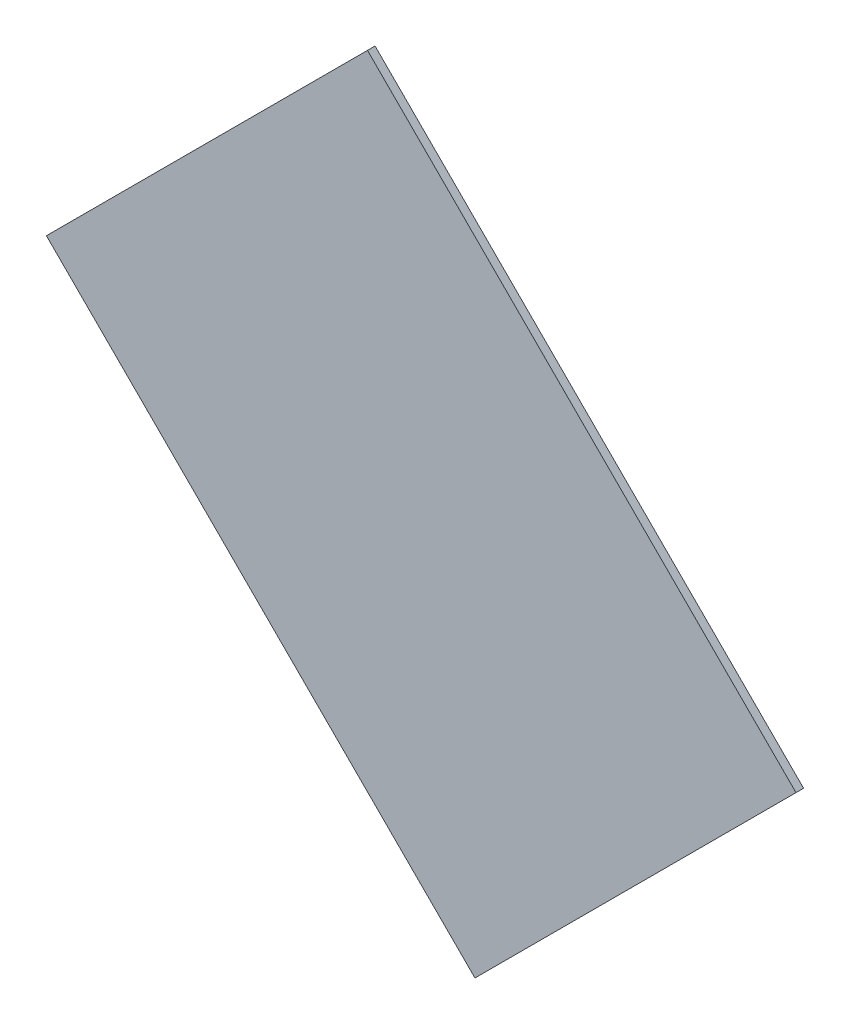
ISO-10303-21;
HEADER;
FILE_DESCRIPTION(('STEP AP214'),'2;1');
FILE_NAME('part.step','',(''),(''),'','','');
FILE_SCHEMA(('AUTOMOTIVE_DESIGN { 1 0 10303 214 1 1 1 1 }'));
ENDSEC;
DATA;
#1=APPLICATION_CONTEXT('core data for automotive mechanical design processes');
#2=APPLICATION_PROTOCOL_DEFINITION('international standard','automotive_design',2000,#1);
#3=PRODUCT_CONTEXT('',#1,'mechanical');
#4=PRODUCT('Part','Part','',(#3));
#5=PRODUCT_RELATED_PRODUCT_CATEGORY('part','',(#4));
#6=PRODUCT_DEFINITION_FORMATION('','',#4);
#7=PRODUCT_DEFINITION_CONTEXT('part definition',#1,'design');
#8=PRODUCT_DEFINITION('design','',#6,#7);
#9=PRODUCT_DEFINITION_SHAPE('','',#8);
#10=(LENGTH_UNIT() NAMED_UNIT(*) SI_UNIT(.MILLI.,.METRE.));
#11=(NAMED_UNIT(*) PLANE_ANGLE_UNIT() SI_UNIT($,.RADIAN.));
#12=(NAMED_UNIT(*) SI_UNIT($,.STERADIAN.) SOLID_ANGLE_UNIT());
#13=UNCERTAINTY_MEASURE_WITH_UNIT(LENGTH_MEASURE(1.E-05),#10,'distance_accuracy_value','');
#14=(GEOMETRIC_REPRESENTATION_CONTEXT(3) GLOBAL_UNCERTAINTY_ASSIGNED_CONTEXT((#13)) GLOBAL_UNIT_ASSIGNED_CONTEXT((#10,
#11,#12)) REPRESENTATION_CONTEXT('',''));
#15=CARTESIAN_POINT('',(0.,0.,0.));
#16=DIRECTION('',(0.,0.,1.));
#17=DIRECTION('',(1.,0.,0.));
#18=AXIS2_PLACEMENT_3D('',#15,#16,#17);
#19=CARTESIAN_POINT('',(-0.07094474000002,0.49480978,0.));
#20=DIRECTION('',(0.707106781186548,-0.707106781186548,0.));
#21=DIRECTION('',(-0.707106781186548,-0.707106781186548,0.));
#22=AXIS2_PLACEMENT_3D('',#19,#20,#21);
#23=PLANE('',#22);
#24=DIRECTION('',(-0.707106781186548,-0.707106781186548,0.));
#25=VECTOR('',#24,1.);
#26=CARTESIAN_POINT('',(-0.07094474000002,0.49480978,0.));
#27=LINE('',#26,#25);
#28=CARTESIAN_POINT('',(-0.07094474000002,0.49480978,0.));
#29=VERTEX_POINT('',#28);
#30=CARTESIAN_POINT('',(-0.49480724,0.07094728000001,0.));
#31=VERTEX_POINT('',#30);
#32=EDGE_CURVE('E11',#29,#31,#27,.T.);
#33=ORIENTED_EDGE('',*,*,#32,.T.);
#34=DIRECTION('',(0.,0.,1.));
#35=VECTOR('',#34,1.);
#36=CARTESIAN_POINT('',(-0.49480724,0.07094728000001,0.));
#37=LINE('',#36,#35);
#38=CARTESIAN_POINT('',(-0.49480724,0.07094728000001,0.00999998));
#39=VERTEX_POINT('',#38);
#40=EDGE_CURVE('E25',#31,#39,#37,.T.);
#41=ORIENTED_EDGE('',*,*,#40,.T.);
#42=DIRECTION('',(-0.707106781186548,-0.707106781186548,0.));
#43=VECTOR('',#42,1.);
#44=CARTESIAN_POINT('',(-0.07094474000002,0.49480978,0.00999998));
#45=LINE('',#44,#43);
#46=CARTESIAN_POINT('',(-0.07094474000002,0.49480978,0.00999998));
#47=VERTEX_POINT('',#46);
#48=EDGE_CURVE('E96',#47,#39,#45,.T.);
#49=ORIENTED_EDGE('',*,*,#48,.F.);
#50=DIRECTION('',(0.,0.,1.));
#51=VECTOR('',#50,1.);
#52=CARTESIAN_POINT('',(-0.07094474000002,0.49480978,0.));
#53=LINE('',#52,#51);
#54=EDGE_CURVE('E91',#29,#47,#53,.T.);
#55=ORIENTED_EDGE('',*,*,#54,.F.);
#56=EDGE_LOOP('',(#33,#41,#49,#55));
#57=FACE_BOUND('',#56,.T.);
#58=ADVANCED_FACE('F17',(#57),#23,.F.);
#59=CARTESIAN_POINT('',(0.49480978,-0.07094727999996,0.));
#60=DIRECTION('',(-0.707108368487266,-0.707105193882266,0.));
#61=DIRECTION('',(-0.707105193882266,0.707108368487266,0.));
#62=AXIS2_PLACEMENT_3D('',#59,#60,#61);
#63=PLANE('',#62);
#64=DIRECTION('',(-0.707105193882266,0.707108368487266,0.));
#65=VECTOR('',#64,1.);
#66=CARTESIAN_POINT('',(0.49480978,-0.07094727999996,0.));
#67=LINE('',#66,#65);
#68=CARTESIAN_POINT('',(0.49480978,-0.07094727999996,0.));
#69=VERTEX_POINT('',#68);
#70=EDGE_CURVE('E73',#69,#29,#67,.T.);
#71=ORIENTED_EDGE('',*,*,#70,.T.);
#72=ORIENTED_EDGE('',*,*,#54,.T.);
#73=DIRECTION('',(-0.707105193882266,0.707108368487266,0.));
#74=VECTOR('',#73,1.);
#75=CARTESIAN_POINT('',(0.49480978,-0.07094727999996,0.00999998));
#76=LINE('',#75,#74);
#77=CARTESIAN_POINT('',(0.49480978,-0.07094727999996,0.00999998));
#78=VERTEX_POINT('',#77);
#79=EDGE_CURVE('E76',#78,#47,#76,.T.);
#80=ORIENTED_EDGE('',*,*,#79,.F.);
#81=DIRECTION('',(0.,0.,1.));
#82=VECTOR('',#81,1.);
#83=CARTESIAN_POINT('',(0.49480978,-0.07094727999996,0.));
#84=LINE('',#83,#82);
#85=EDGE_CURVE('E74',#69,#78,#84,.T.);
#86=ORIENTED_EDGE('',*,*,#85,.F.);
#87=EDGE_LOOP('',(#71,#72,#80,#86));
#88=FACE_BOUND('',#87,.T.);
#89=ADVANCED_FACE('F108',(#88),#63,.F.);
#90=CARTESIAN_POINT('',(0.07094727999998,-0.49480978,0.));
#91=DIRECTION('',(-0.707106781186548,0.707106781186548,0.));
#92=DIRECTION('',(0.707106781186548,0.707106781186548,0.));
#93=AXIS2_PLACEMENT_3D('',#90,#91,#92);
#94=PLANE('',#93);
#95=DIRECTION('',(0.707106781186548,0.707106781186548,0.));
#96=VECTOR('',#95,1.);
#97=CARTESIAN_POINT('',(0.07094727999998,-0.49480978,0.));
#98=LINE('',#97,#96);
#99=CARTESIAN_POINT('',(0.07094727999998,-0.49480978,0.));
#100=VERTEX_POINT('',#99);
#101=EDGE_CURVE('E59',#100,#69,#98,.T.);
#102=ORIENTED_EDGE('',*,*,#101,.T.);
#103=ORIENTED_EDGE('',*,*,#85,.T.);
#104=DIRECTION('',(0.707106781186548,0.707106781186548,0.));
#105=VECTOR('',#104,1.);
#106=CARTESIAN_POINT('',(0.07094727999998,-0.49480978,0.00999998));
#107=LINE('',#106,#105);
#108=CARTESIAN_POINT('',(0.07094727999998,-0.49480978,0.00999998));
#109=VERTEX_POINT('',#108);
#110=EDGE_CURVE('E62',#109,#78,#107,.T.);
#111=ORIENTED_EDGE('',*,*,#110,.F.);
#112=DIRECTION('',(0.,0.,1.));
#113=VECTOR('',#112,1.);
#114=CARTESIAN_POINT('',(0.07094727999998,-0.49480978,0.));
#115=LINE('',#114,#113);
#116=EDGE_CURVE('E54',#100,#109,#115,.T.);
#117=ORIENTED_EDGE('',*,*,#116,.F.);
#118=EDGE_LOOP('',(#102,#103,#111,#117));
#119=FACE_BOUND('',#118,.T.);
#120=ADVANCED_FACE('F56',(#119),#94,.F.);
#121=CARTESIAN_POINT('',(-0.49480724,0.07094728000001,0.));
#122=DIRECTION('',(0.707108368487266,0.707105193882266,0.));
#123=DIRECTION('',(0.707105193882266,-0.707108368487266,0.));
#124=AXIS2_PLACEMENT_3D('',#121,#122,#123);
#125=PLANE('',#124);
#126=DIRECTION('',(0.707105193882266,-0.707108368487266,0.));
#127=VECTOR('',#126,1.);
#128=CARTESIAN_POINT('',(-0.49480724,0.07094728000001,0.));
#129=LINE('',#128,#127);
#130=EDGE_CURVE('E65',#31,#100,#129,.T.);
#131=ORIENTED_EDGE('',*,*,#130,.T.);
#132=ORIENTED_EDGE('',*,*,#116,.T.);
#133=DIRECTION('',(0.707105193882266,-0.707108368487266,0.));
#134=VECTOR('',#133,1.);
#135=CARTESIAN_POINT('',(-0.49480724,0.07094728000001,0.00999998));
#136=LINE('',#135,#134);
#137=EDGE_CURVE('E69',#39,#109,#136,.T.);
#138=ORIENTED_EDGE('',*,*,#137,.F.);
#139=ORIENTED_EDGE('',*,*,#40,.F.);
#140=EDGE_LOOP('',(#131,#132,#138,#139));
#141=FACE_BOUND('',#140,.T.);
#142=ADVANCED_FACE('F67',(#141),#125,.F.);
#143=CARTESIAN_POINT('',(1.270000006118E-06,0.,0.00999998));
#144=DIRECTION('',(0.,0.,1.));
#145=DIRECTION('',(1.,0.,0.));
#146=AXIS2_PLACEMENT_3D('',#143,#144,#145);
#147=PLANE('',#146);
#148=ORIENTED_EDGE('',*,*,#48,.T.);
#149=ORIENTED_EDGE('',*,*,#137,.T.);
#150=ORIENTED_EDGE('',*,*,#110,.T.);
#151=ORIENTED_EDGE('',*,*,#79,.T.);
#152=EDGE_LOOP('',(#148,#149,#150,#151));
#153=FACE_BOUND('',#152,.T.);
#154=ADVANCED_FACE('F106',(#153),#147,.T.);
#155=CARTESIAN_POINT('',(1.270000006118E-06,0.,0.));
#156=DIRECTION('',(0.,0.,1.));
#157=DIRECTION('',(1.,0.,0.));
#158=AXIS2_PLACEMENT_3D('',#155,#156,#157);
#159=PLANE('',#158);
#160=ORIENTED_EDGE('',*,*,#70,.F.);
#161=ORIENTED_EDGE('',*,*,#101,.F.);
#162=ORIENTED_EDGE('',*,*,#130,.F.);
#163=ORIENTED_EDGE('',*,*,#32,.F.);
#164=EDGE_LOOP('',(#160,#161,#162,#163));
#165=FACE_BOUND('',#164,.T.);
#166=ADVANCED_FACE('F71',(#165),#159,.F.);
#167=CLOSED_SHELL('',(#58,#89,#120,#142,#154,#166));
#168=MANIFOLD_SOLID_BREP('B1',#167);
#169=ADVANCED_BREP_SHAPE_REPRESENTATION('',(#18,#168),#14);
#170=SHAPE_DEFINITION_REPRESENTATION(#9,#169);
ENDSEC;
END-ISO-10303-21;
